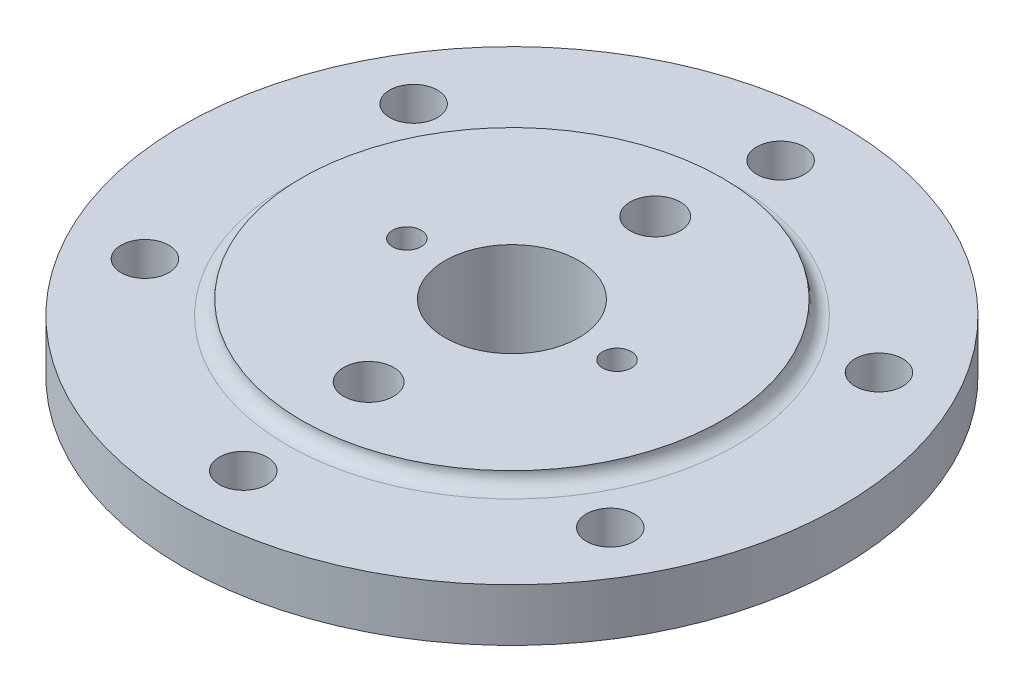
ISO-10303-21;
HEADER;
FILE_DESCRIPTION(('STEP AP214'),'2;1');
FILE_NAME('part.step','',(''),(''),'','','');
FILE_SCHEMA(('AUTOMOTIVE_DESIGN { 1 0 10303 214 1 1 1 1 }'));
ENDSEC;
DATA;
#1=APPLICATION_CONTEXT('core data for automotive mechanical design processes');
#2=APPLICATION_PROTOCOL_DEFINITION('international standard','automotive_design',2000,#1);
#3=PRODUCT_CONTEXT('',#1,'mechanical');
#4=PRODUCT('Part','Part','',(#3));
#5=PRODUCT_RELATED_PRODUCT_CATEGORY('part','',(#4));
#6=PRODUCT_DEFINITION_FORMATION('','',#4);
#7=PRODUCT_DEFINITION_CONTEXT('part definition',#1,'design');
#8=PRODUCT_DEFINITION('design','',#6,#7);
#9=PRODUCT_DEFINITION_SHAPE('','',#8);
#10=(LENGTH_UNIT() NAMED_UNIT(*) SI_UNIT(.MILLI.,.METRE.));
#11=(NAMED_UNIT(*) PLANE_ANGLE_UNIT() SI_UNIT($,.RADIAN.));
#12=(NAMED_UNIT(*) SI_UNIT($,.STERADIAN.) SOLID_ANGLE_UNIT());
#13=UNCERTAINTY_MEASURE_WITH_UNIT(LENGTH_MEASURE(1.E-05),#10,'distance_accuracy_value','');
#14=(GEOMETRIC_REPRESENTATION_CONTEXT(3) GLOBAL_UNCERTAINTY_ASSIGNED_CONTEXT((#13)) GLOBAL_UNIT_ASSIGNED_CONTEXT((#10,
#11,#12)) REPRESENTATION_CONTEXT('',''));
#15=CARTESIAN_POINT('',(0.,0.,0.));
#16=DIRECTION('',(0.,0.,1.));
#17=DIRECTION('',(1.,0.,0.));
#18=AXIS2_PLACEMENT_3D('',#15,#16,#17);
#19=CARTESIAN_POINT('',(0.,0.,0.));
#20=DIRECTION('',(0.,1.,0.));
#21=DIRECTION('',(0.,0.,1.));
#22=AXIS2_PLACEMENT_3D('',#19,#20,#21);
#23=TOROIDAL_SURFACE('',#22,94.,6.);
#24=CARTESIAN_POINT('',(0.,0.,0.));
#25=DIRECTION('',(0.,1.,0.));
#26=DIRECTION('',(0.,0.,1.));
#27=AXIS2_PLACEMENT_3D('',#24,#25,#26);
#28=CIRCLE('',#27,88.);
#29=CARTESIAN_POINT('',(0.,0.,88.));
#30=VERTEX_POINT('',#29);
#31=EDGE_CURVE('E11',#30,#30,#28,.T.);
#32=ORIENTED_EDGE('',*,*,#31,.F.);
#33=EDGE_LOOP('',(#32));
#34=FACE_BOUND('',#33,.T.);
#35=CARTESIAN_POINT('',(0.,-6.00000000000002,0.));
#36=DIRECTION('',(0.,1.,0.));
#37=DIRECTION('',(0.,0.,1.));
#38=AXIS2_PLACEMENT_3D('',#35,#36,#37);
#39=CIRCLE('',#38,94.);
#40=CARTESIAN_POINT('',(0.,-6.00000000000003,94.));
#41=VERTEX_POINT('',#40);
#42=EDGE_CURVE('E138',#41,#41,#39,.T.);
#43=ORIENTED_EDGE('',*,*,#42,.T.);
#44=EDGE_LOOP('',(#43));
#45=FACE_BOUND('',#44,.T.);
#46=ADVANCED_FACE('F49',(#34,#45),#23,.F.);
#47=CARTESIAN_POINT('',(0.,0.,-28.));
#48=DIRECTION('',(0.,-1.,0.));
#49=DIRECTION('',(0.,0.,-1.));
#50=AXIS2_PLACEMENT_3D('',#47,#48,#49);
#51=PLANE('',#50);
#52=CARTESIAN_POINT('',(-44.,0.,0.));
#53=DIRECTION('',(0.,1.,0.));
#54=DIRECTION('',(0.,0.,1.));
#55=AXIS2_PLACEMENT_3D('',#52,#53,#54);
#56=CIRCLE('',#55,6.);
#57=CARTESIAN_POINT('',(-44.,0.,6.));
#58=VERTEX_POINT('',#57);
#59=EDGE_CURVE('E80',#58,#58,#56,.T.);
#60=ORIENTED_EDGE('',*,*,#59,.F.);
#61=EDGE_LOOP('',(#60));
#62=FACE_BOUND('',#61,.T.);
#63=CARTESIAN_POINT('',(44.,0.,0.));
#64=DIRECTION('',(0.,1.,0.));
#65=DIRECTION('',(0.,0.,1.));
#66=AXIS2_PLACEMENT_3D('',#63,#64,#65);
#67=CIRCLE('',#66,6.);
#68=CARTESIAN_POINT('',(44.,0.,5.99999999999998));
#69=VERTEX_POINT('',#68);
#70=EDGE_CURVE('E79',#69,#69,#67,.T.);
#71=ORIENTED_EDGE('',*,*,#70,.F.);
#72=EDGE_LOOP('',(#71));
#73=FACE_BOUND('',#72,.T.);
#74=CARTESIAN_POINT('',(0.,0.,-60.));
#75=DIRECTION('',(0.,1.,0.));
#76=DIRECTION('',(0.,0.,1.));
#77=AXIS2_PLACEMENT_3D('',#74,#75,#76);
#78=CIRCLE('',#77,10.5);
#79=CARTESIAN_POINT('',(0.,0.,-49.5));
#80=VERTEX_POINT('',#79);
#81=EDGE_CURVE('E90',#80,#80,#78,.T.);
#82=ORIENTED_EDGE('',*,*,#81,.F.);
#83=EDGE_LOOP('',(#82));
#84=FACE_BOUND('',#83,.T.);
#85=CARTESIAN_POINT('',(0.,0.,60.));
#86=DIRECTION('',(0.,1.,0.));
#87=DIRECTION('',(0.,0.,1.));
#88=AXIS2_PLACEMENT_3D('',#85,#86,#87);
#89=CIRCLE('',#88,10.5);
#90=CARTESIAN_POINT('',(0.,0.,70.5));
#91=VERTEX_POINT('',#90);
#92=EDGE_CURVE('E96',#91,#91,#89,.T.);
#93=ORIENTED_EDGE('',*,*,#92,.F.);
#94=EDGE_LOOP('',(#93));
#95=FACE_BOUND('',#94,.T.);
#96=CARTESIAN_POINT('',(0.,0.,0.));
#97=DIRECTION('',(0.,1.,0.));
#98=DIRECTION('',(0.,0.,1.));
#99=AXIS2_PLACEMENT_3D('',#96,#97,#98);
#100=CIRCLE('',#99,28.);
#101=CARTESIAN_POINT('',(0.,0.,28.));
#102=VERTEX_POINT('',#101);
#103=EDGE_CURVE('E56',#102,#102,#100,.T.);
#104=ORIENTED_EDGE('',*,*,#103,.F.);
#105=EDGE_LOOP('',(#104));
#106=FACE_BOUND('',#105,.T.);
#107=ORIENTED_EDGE('',*,*,#31,.T.);
#108=EDGE_LOOP('',(#107));
#109=FACE_BOUND('',#108,.T.);
#110=ADVANCED_FACE('F169',(#62,#73,#84,#95,#106,#109),#51,.F.);
#111=CARTESIAN_POINT('',(0.,70.4543042547886,0.));
#112=DIRECTION('',(0.,1.,0.));
#113=DIRECTION('',(0.,0.,1.));
#114=AXIS2_PLACEMENT_3D('',#111,#112,#113);
#115=CYLINDRICAL_SURFACE('',#114,28.);
#116=CARTESIAN_POINT('',(0.,-41.9170962313453,0.));
#117=DIRECTION('',(0.,1.,0.));
#118=DIRECTION('',(0.,0.,1.));
#119=AXIS2_PLACEMENT_3D('',#116,#117,#118);
#120=CIRCLE('',#119,28.);
#121=CARTESIAN_POINT('',(0.,-41.9170962313453,28.));
#122=VERTEX_POINT('',#121);
#123=EDGE_CURVE('E162',#122,#122,#120,.T.);
#124=ORIENTED_EDGE('',*,*,#123,.F.);
#125=EDGE_LOOP('',(#124));
#126=FACE_BOUND('',#125,.T.);
#127=ORIENTED_EDGE('',*,*,#103,.T.);
#128=EDGE_LOOP('',(#127));
#129=FACE_BOUND('',#128,.T.);
#130=ADVANCED_FACE('F167',(#126,#129),#115,.F.);
#131=CARTESIAN_POINT('',(0.,-41.9170962313453,0.));
#132=DIRECTION('',(0.,1.,0.));
#133=DIRECTION('',(0.,0.,1.));
#134=AXIS2_PLACEMENT_3D('',#131,#132,#133);
#135=CONICAL_SURFACE('',#134,28.,1.0471975511966);
#136=CARTESIAN_POINT('',(0.,-50.,0.));
#137=DIRECTION('',(0.,1.,0.));
#138=DIRECTION('',(0.,0.,1.));
#139=AXIS2_PLACEMENT_3D('',#136,#137,#138);
#140=CIRCLE('',#139,14.);
#141=CARTESIAN_POINT('',(0.,-50.,14.));
#142=VERTEX_POINT('',#141);
#143=EDGE_CURVE('E159',#142,#142,#140,.T.);
#144=ORIENTED_EDGE('',*,*,#143,.F.);
#145=EDGE_LOOP('',(#144));
#146=FACE_BOUND('',#145,.T.);
#147=ORIENTED_EDGE('',*,*,#123,.T.);
#148=EDGE_LOOP('',(#147));
#149=FACE_BOUND('',#148,.T.);
#150=ADVANCED_FACE('F221',(#146,#149),#135,.F.);
#151=CARTESIAN_POINT('',(0.,70.4543042547886,0.));
#152=DIRECTION('',(0.,1.,0.));
#153=DIRECTION('',(0.,0.,1.));
#154=AXIS2_PLACEMENT_3D('',#151,#152,#153);
#155=CYLINDRICAL_SURFACE('',#154,14.);
#156=CARTESIAN_POINT('',(0.,-81.,0.));
#157=DIRECTION('',(0.,1.,0.));
#158=DIRECTION('',(0.,0.,1.));
#159=AXIS2_PLACEMENT_3D('',#156,#157,#158);
#160=CIRCLE('',#159,14.);
#161=CARTESIAN_POINT('',(0.,-81.,14.));
#162=VERTEX_POINT('',#161);
#163=EDGE_CURVE('E156',#162,#162,#160,.T.);
#164=ORIENTED_EDGE('',*,*,#163,.F.);
#165=EDGE_LOOP('',(#164));
#166=FACE_BOUND('',#165,.T.);
#167=ORIENTED_EDGE('',*,*,#143,.T.);
#168=EDGE_LOOP('',(#167));
#169=FACE_BOUND('',#168,.T.);
#170=ADVANCED_FACE('F215',(#166,#169),#155,.F.);
#171=CARTESIAN_POINT('',(0.,-81.,-35.));
#172=DIRECTION('',(0.,1.,0.));
#173=DIRECTION('',(0.,0.,1.));
#174=AXIS2_PLACEMENT_3D('',#171,#172,#173);
#175=PLANE('',#174);
#176=CARTESIAN_POINT('',(0.,-81.,0.));
#177=DIRECTION('',(0.,1.,0.));
#178=DIRECTION('',(0.,0.,1.));
#179=AXIS2_PLACEMENT_3D('',#176,#177,#178);
#180=CIRCLE('',#179,35.);
#181=CARTESIAN_POINT('',(0.,-81.,35.));
#182=VERTEX_POINT('',#181);
#183=EDGE_CURVE('E153',#182,#182,#180,.T.);
#184=ORIENTED_EDGE('',*,*,#183,.F.);
#185=EDGE_LOOP('',(#184));
#186=FACE_BOUND('',#185,.T.);
#187=ORIENTED_EDGE('',*,*,#163,.T.);
#188=EDGE_LOOP('',(#187));
#189=FACE_BOUND('',#188,.T.);
#190=ADVANCED_FACE('F209',(#186,#189),#175,.F.);
#191=CARTESIAN_POINT('',(0.,-81.,0.));
#192=DIRECTION('',(0.,1.,0.));
#193=DIRECTION('',(0.,0.,1.));
#194=AXIS2_PLACEMENT_3D('',#191,#192,#193);
#195=CONICAL_SURFACE('',#194,35.,0.774645889606347);
#196=CARTESIAN_POINT('',(0.,-34.,0.));
#197=DIRECTION('',(0.,1.,0.));
#198=DIRECTION('',(0.,0.,1.));
#199=AXIS2_PLACEMENT_3D('',#196,#197,#198);
#200=CIRCLE('',#199,81.);
#201=CARTESIAN_POINT('',(0.,-34.,81.));
#202=VERTEX_POINT('',#201);
#203=EDGE_CURVE('E150',#202,#202,#200,.T.);
#204=ORIENTED_EDGE('',*,*,#203,.F.);
#205=EDGE_LOOP('',(#204));
#206=FACE_BOUND('',#205,.T.);
#207=ORIENTED_EDGE('',*,*,#183,.T.);
#208=EDGE_LOOP('',(#207));
#209=FACE_BOUND('',#208,.T.);
#210=ADVANCED_FACE('F203',(#206,#209),#195,.T.);
#211=CARTESIAN_POINT('',(0.,70.4543042547886,0.));
#212=DIRECTION('',(0.,1.,0.));
#213=DIRECTION('',(0.,0.,1.));
#214=AXIS2_PLACEMENT_3D('',#211,#212,#213);
#215=CYLINDRICAL_SURFACE('',#214,81.);
#216=CARTESIAN_POINT('',(0.,-28.,0.));
#217=DIRECTION('',(0.,1.,0.));
#218=DIRECTION('',(0.,0.,1.));
#219=AXIS2_PLACEMENT_3D('',#216,#217,#218);
#220=CIRCLE('',#219,81.);
#221=CARTESIAN_POINT('',(0.,-28.,81.));
#222=VERTEX_POINT('',#221);
#223=EDGE_CURVE('E147',#222,#222,#220,.T.);
#224=ORIENTED_EDGE('',*,*,#223,.F.);
#225=EDGE_LOOP('',(#224));
#226=FACE_BOUND('',#225,.T.);
#227=ORIENTED_EDGE('',*,*,#203,.T.);
#228=EDGE_LOOP('',(#227));
#229=FACE_BOUND('',#228,.T.);
#230=ADVANCED_FACE('F196',(#226,#229),#215,.T.);
#231=CARTESIAN_POINT('',(0.,-28.,-138.));
#232=DIRECTION('',(0.,1.,0.));
#233=DIRECTION('',(0.,0.,1.));
#234=AXIS2_PLACEMENT_3D('',#231,#232,#233);
#235=PLANE('',#234);
#236=CARTESIAN_POINT('',(0.,-28.,-112.5));
#237=DIRECTION('',(0.,1.,0.));
#238=DIRECTION('',(0.,0.,1.));
#239=AXIS2_PLACEMENT_3D('',#236,#237,#238);
#240=CIRCLE('',#239,10.);
#241=CARTESIAN_POINT('',(0.,-28.,-102.5));
#242=VERTEX_POINT('',#241);
#243=EDGE_CURVE('E135',#242,#242,#240,.T.);
#244=ORIENTED_EDGE('',*,*,#243,.T.);
#245=EDGE_LOOP('',(#244));
#246=FACE_BOUND('',#245,.T.);
#247=CARTESIAN_POINT('',(-97.4278579257494,-28.,-56.2499999999999));
#248=DIRECTION('',(0.,1.,0.));
#249=DIRECTION('',(0.,0.,1.));
#250=AXIS2_PLACEMENT_3D('',#247,#248,#249);
#251=CIRCLE('',#250,10.0000000000013);
#252=CARTESIAN_POINT('',(-97.4278579257494,-28.,-46.2499999999986));
#253=VERTEX_POINT('',#252);
#254=EDGE_CURVE('E132',#253,#253,#251,.T.);
#255=ORIENTED_EDGE('',*,*,#254,.T.);
#256=EDGE_LOOP('',(#255));
#257=FACE_BOUND('',#256,.T.);
#258=CARTESIAN_POINT('',(-97.4278579257493,-28.,56.25));
#259=DIRECTION('',(0.,1.,0.));
#260=DIRECTION('',(0.,0.,1.));
#261=AXIS2_PLACEMENT_3D('',#258,#259,#260);
#262=CIRCLE('',#261,10.000000000001);
#263=CARTESIAN_POINT('',(-97.4278579257493,-28.,66.2500000000011));
#264=VERTEX_POINT('',#263);
#265=EDGE_CURVE('E129',#264,#264,#262,.T.);
#266=ORIENTED_EDGE('',*,*,#265,.T.);
#267=EDGE_LOOP('',(#266));
#268=FACE_BOUND('',#267,.T.);
#269=CARTESIAN_POINT('',(0.,-28.,112.5));
#270=DIRECTION('',(0.,1.,0.));
#271=DIRECTION('',(0.,0.,1.));
#272=AXIS2_PLACEMENT_3D('',#269,#270,#271);
#273=CIRCLE('',#272,10.0000000000008);
#274=CARTESIAN_POINT('',(0.,-28.,122.500000000001));
#275=VERTEX_POINT('',#274);
#276=EDGE_CURVE('E126',#275,#275,#273,.T.);
#277=ORIENTED_EDGE('',*,*,#276,.T.);
#278=EDGE_LOOP('',(#277));
#279=FACE_BOUND('',#278,.T.);
#280=CARTESIAN_POINT('',(97.4278579257494,-28.,56.25));
#281=DIRECTION('',(0.,1.,0.));
#282=DIRECTION('',(0.,0.,1.));
#283=AXIS2_PLACEMENT_3D('',#280,#281,#282);
#284=CIRCLE('',#283,10.0000000000005);
#285=CARTESIAN_POINT('',(97.4278579257494,-28.,66.2500000000005));
#286=VERTEX_POINT('',#285);
#287=EDGE_CURVE('E123',#286,#286,#284,.T.);
#288=ORIENTED_EDGE('',*,*,#287,.T.);
#289=EDGE_LOOP('',(#288));
#290=FACE_BOUND('',#289,.T.);
#291=CARTESIAN_POINT('',(97.4278579257493,-28.,-56.25));
#292=DIRECTION('',(0.,1.,0.));
#293=DIRECTION('',(0.,0.,1.));
#294=AXIS2_PLACEMENT_3D('',#291,#292,#293);
#295=CIRCLE('',#294,10.0000000000003);
#296=CARTESIAN_POINT('',(97.4278579257493,-28.,-46.2499999999998));
#297=VERTEX_POINT('',#296);
#298=EDGE_CURVE('E106',#297,#297,#295,.T.);
#299=ORIENTED_EDGE('',*,*,#298,.T.);
#300=EDGE_LOOP('',(#299));
#301=FACE_BOUND('',#300,.T.);
#302=CARTESIAN_POINT('',(0.,-28.,0.));
#303=DIRECTION('',(0.,1.,0.));
#304=DIRECTION('',(0.,0.,1.));
#305=AXIS2_PLACEMENT_3D('',#302,#303,#304);
#306=CIRCLE('',#305,138.);
#307=CARTESIAN_POINT('',(0.,-28.,138.));
#308=VERTEX_POINT('',#307);
#309=EDGE_CURVE('E144',#308,#308,#306,.T.);
#310=ORIENTED_EDGE('',*,*,#309,.F.);
#311=EDGE_LOOP('',(#310));
#312=FACE_BOUND('',#311,.T.);
#313=ORIENTED_EDGE('',*,*,#223,.T.);
#314=EDGE_LOOP('',(#313));
#315=FACE_BOUND('',#314,.T.);
#316=ADVANCED_FACE('F190',(#246,#257,#268,#279,#290,#301,#312,#315),#235,.F.);
#317=CARTESIAN_POINT('',(0.,70.4543042547886,0.));
#318=DIRECTION('',(0.,1.,0.));
#319=DIRECTION('',(0.,0.,1.));
#320=AXIS2_PLACEMENT_3D('',#317,#318,#319);
#321=CYLINDRICAL_SURFACE('',#320,138.);
#322=CARTESIAN_POINT('',(0.,-6.00000000000002,0.));
#323=DIRECTION('',(0.,1.,0.));
#324=DIRECTION('',(0.,0.,1.));
#325=AXIS2_PLACEMENT_3D('',#322,#323,#324);
#326=CIRCLE('',#325,138.);
#327=CARTESIAN_POINT('',(0.,-6.00000000000004,138.));
#328=VERTEX_POINT('',#327);
#329=EDGE_CURVE('E141',#328,#328,#326,.T.);
#330=ORIENTED_EDGE('',*,*,#329,.F.);
#331=EDGE_LOOP('',(#330));
#332=FACE_BOUND('',#331,.T.);
#333=ORIENTED_EDGE('',*,*,#309,.T.);
#334=EDGE_LOOP('',(#333));
#335=FACE_BOUND('',#334,.T.);
#336=ADVANCED_FACE('F183',(#332,#335),#321,.T.);
#337=CARTESIAN_POINT('',(0.,-6.,-94.));
#338=DIRECTION('',(0.,-1.,0.));
#339=DIRECTION('',(0.,0.,-1.));
#340=AXIS2_PLACEMENT_3D('',#337,#338,#339);
#341=PLANE('',#340);
#342=CARTESIAN_POINT('',(0.,-6.,-112.5));
#343=DIRECTION('',(0.,1.,0.));
#344=DIRECTION('',(0.,0.,1.));
#345=AXIS2_PLACEMENT_3D('',#342,#343,#344);
#346=CIRCLE('',#345,10.);
#347=CARTESIAN_POINT('',(0.,-6.,-102.5));
#348=VERTEX_POINT('',#347);
#349=EDGE_CURVE('E103',#348,#348,#346,.T.);
#350=ORIENTED_EDGE('',*,*,#349,.F.);
#351=EDGE_LOOP('',(#350));
#352=FACE_BOUND('',#351,.T.);
#353=CARTESIAN_POINT('',(-97.4278579257494,-6.00000000000001,-56.2499999999999));
#354=DIRECTION('',(0.,1.,0.));
#355=DIRECTION('',(0.,0.,1.));
#356=AXIS2_PLACEMENT_3D('',#353,#354,#355);
#357=CIRCLE('',#356,10.0000000000013);
#358=CARTESIAN_POINT('',(-97.4278579257494,-6.00000000000001,-46.2499999999986));
#359=VERTEX_POINT('',#358);
#360=EDGE_CURVE('E102',#359,#359,#357,.T.);
#361=ORIENTED_EDGE('',*,*,#360,.F.);
#362=EDGE_LOOP('',(#361));
#363=FACE_BOUND('',#362,.T.);
#364=CARTESIAN_POINT('',(-97.4278579257493,-6.00000000000002,56.25));
#365=DIRECTION('',(0.,1.,0.));
#366=DIRECTION('',(0.,0.,1.));
#367=AXIS2_PLACEMENT_3D('',#364,#365,#366);
#368=CIRCLE('',#367,10.000000000001);
#369=CARTESIAN_POINT('',(-97.4278579257493,-6.00000000000002,66.2500000000011));
#370=VERTEX_POINT('',#369);
#371=EDGE_CURVE('E110',#370,#370,#368,.T.);
#372=ORIENTED_EDGE('',*,*,#371,.F.);
#373=EDGE_LOOP('',(#372));
#374=FACE_BOUND('',#373,.T.);
#375=CARTESIAN_POINT('',(0.,-6.00000000000003,112.5));
#376=DIRECTION('',(0.,1.,0.));
#377=DIRECTION('',(0.,0.,1.));
#378=AXIS2_PLACEMENT_3D('',#375,#376,#377);
#379=CIRCLE('',#378,10.0000000000008);
#380=CARTESIAN_POINT('',(0.,-6.00000000000003,122.500000000001));
#381=VERTEX_POINT('',#380);
#382=EDGE_CURVE('E116',#381,#381,#379,.T.);
#383=ORIENTED_EDGE('',*,*,#382,.F.);
#384=EDGE_LOOP('',(#383));
#385=FACE_BOUND('',#384,.T.);
#386=CARTESIAN_POINT('',(97.4278579257494,-6.00000000000002,56.25));
#387=DIRECTION('',(0.,1.,0.));
#388=DIRECTION('',(0.,0.,1.));
#389=AXIS2_PLACEMENT_3D('',#386,#387,#388);
#390=CIRCLE('',#389,10.0000000000005);
#391=CARTESIAN_POINT('',(97.4278579257494,-6.00000000000002,66.2500000000005));
#392=VERTEX_POINT('',#391);
#393=EDGE_CURVE('E113',#392,#392,#390,.T.);
#394=ORIENTED_EDGE('',*,*,#393,.F.);
#395=EDGE_LOOP('',(#394));
#396=FACE_BOUND('',#395,.T.);
#397=CARTESIAN_POINT('',(97.4278579257493,-6.00000000000001,-56.25));
#398=DIRECTION('',(0.,1.,0.));
#399=DIRECTION('',(0.,0.,1.));
#400=AXIS2_PLACEMENT_3D('',#397,#398,#399);
#401=CIRCLE('',#400,10.0000000000003);
#402=CARTESIAN_POINT('',(97.4278579257493,-6.00000000000001,-46.2499999999998));
#403=VERTEX_POINT('',#402);
#404=EDGE_CURVE('E107',#403,#403,#401,.T.);
#405=ORIENTED_EDGE('',*,*,#404,.F.);
#406=EDGE_LOOP('',(#405));
#407=FACE_BOUND('',#406,.T.);
#408=ORIENTED_EDGE('',*,*,#42,.F.);
#409=EDGE_LOOP('',(#408));
#410=FACE_BOUND('',#409,.T.);
#411=ORIENTED_EDGE('',*,*,#329,.T.);
#412=EDGE_LOOP('',(#411));
#413=FACE_BOUND('',#412,.T.);
#414=ADVANCED_FACE('F179',(#352,#363,#374,#385,#396,#407,#410,#413),#341,.F.);
#415=CARTESIAN_POINT('',(97.4278579257493,-81.,-56.25));
#416=DIRECTION('',(0.,1.,0.));
#417=DIRECTION('',(0.,0.,1.));
#418=AXIS2_PLACEMENT_3D('',#415,#416,#417);
#419=CYLINDRICAL_SURFACE('',#418,10.0000000000003);
#420=ORIENTED_EDGE('',*,*,#404,.T.);
#421=EDGE_LOOP('',(#420));
#422=FACE_BOUND('',#421,.T.);
#423=ORIENTED_EDGE('',*,*,#298,.F.);
#424=EDGE_LOOP('',(#423));
#425=FACE_BOUND('',#424,.T.);
#426=ADVANCED_FACE('F182',(#422,#425),#419,.F.);
#427=CARTESIAN_POINT('',(97.4278579257494,-81.,56.25));
#428=DIRECTION('',(0.,1.,0.));
#429=DIRECTION('',(0.,0.,1.));
#430=AXIS2_PLACEMENT_3D('',#427,#428,#429);
#431=CYLINDRICAL_SURFACE('',#430,10.0000000000005);
#432=ORIENTED_EDGE('',*,*,#393,.T.);
#433=EDGE_LOOP('',(#432));
#434=FACE_BOUND('',#433,.T.);
#435=ORIENTED_EDGE('',*,*,#287,.F.);
#436=EDGE_LOOP('',(#435));
#437=FACE_BOUND('',#436,.T.);
#438=ADVANCED_FACE('F243',(#434,#437),#431,.F.);
#439=CARTESIAN_POINT('',(0.,-81.0000000000001,112.5));
#440=DIRECTION('',(0.,1.,0.));
#441=DIRECTION('',(0.,0.,1.));
#442=AXIS2_PLACEMENT_3D('',#439,#440,#441);
#443=CYLINDRICAL_SURFACE('',#442,10.0000000000008);
#444=ORIENTED_EDGE('',*,*,#382,.T.);
#445=EDGE_LOOP('',(#444));
#446=FACE_BOUND('',#445,.T.);
#447=ORIENTED_EDGE('',*,*,#276,.F.);
#448=EDGE_LOOP('',(#447));
#449=FACE_BOUND('',#448,.T.);
#450=ADVANCED_FACE('F239',(#446,#449),#443,.F.);
#451=CARTESIAN_POINT('',(-97.4278579257493,-81.,56.25));
#452=DIRECTION('',(0.,1.,0.));
#453=DIRECTION('',(0.,0.,1.));
#454=AXIS2_PLACEMENT_3D('',#451,#452,#453);
#455=CYLINDRICAL_SURFACE('',#454,10.000000000001);
#456=ORIENTED_EDGE('',*,*,#371,.T.);
#457=EDGE_LOOP('',(#456));
#458=FACE_BOUND('',#457,.T.);
#459=ORIENTED_EDGE('',*,*,#265,.F.);
#460=EDGE_LOOP('',(#459));
#461=FACE_BOUND('',#460,.T.);
#462=ADVANCED_FACE('F235',(#458,#461),#455,.F.);
#463=CARTESIAN_POINT('',(-97.4278579257494,-81.,-56.2499999999999));
#464=DIRECTION('',(0.,1.,0.));
#465=DIRECTION('',(0.,0.,1.));
#466=AXIS2_PLACEMENT_3D('',#463,#464,#465);
#467=CYLINDRICAL_SURFACE('',#466,10.0000000000013);
#468=ORIENTED_EDGE('',*,*,#360,.T.);
#469=EDGE_LOOP('',(#468));
#470=FACE_BOUND('',#469,.T.);
#471=ORIENTED_EDGE('',*,*,#254,.F.);
#472=EDGE_LOOP('',(#471));
#473=FACE_BOUND('',#472,.T.);
#474=ADVANCED_FACE('F238',(#470,#473),#467,.F.);
#475=CARTESIAN_POINT('',(0.,-81.,-112.5));
#476=DIRECTION('',(0.,1.,0.));
#477=DIRECTION('',(0.,0.,1.));
#478=AXIS2_PLACEMENT_3D('',#475,#476,#477);
#479=CYLINDRICAL_SURFACE('',#478,10.);
#480=ORIENTED_EDGE('',*,*,#349,.T.);
#481=EDGE_LOOP('',(#480));
#482=FACE_BOUND('',#481,.T.);
#483=ORIENTED_EDGE('',*,*,#243,.F.);
#484=EDGE_LOOP('',(#483));
#485=FACE_BOUND('',#484,.T.);
#486=ADVANCED_FACE('F253',(#482,#485),#479,.F.);
#487=CARTESIAN_POINT('',(0.,-27.,60.));
#488=DIRECTION('',(0.,1.,0.));
#489=DIRECTION('',(0.,0.,1.));
#490=AXIS2_PLACEMENT_3D('',#487,#488,#489);
#491=CONICAL_SURFACE('',#490,10.5,1.0471975511966);
#492=CARTESIAN_POINT('',(0.,-33.0621778264911,60.));
#493=VERTEX_POINT('',#492);
#494=VERTEX_LOOP('',#493);
#495=FACE_BOUND('',#494,.T.);
#496=CARTESIAN_POINT('',(0.,-27.,60.));
#497=DIRECTION('',(0.,1.,0.));
#498=DIRECTION('',(0.,0.,1.));
#499=AXIS2_PLACEMENT_3D('',#496,#497,#498);
#500=CIRCLE('',#499,10.5);
#501=CARTESIAN_POINT('',(0.,-27.,70.5));
#502=VERTEX_POINT('',#501);
#503=EDGE_CURVE('E99',#502,#502,#500,.T.);
#504=ORIENTED_EDGE('',*,*,#503,.T.);
#505=EDGE_LOOP('',(#504));
#506=FACE_BOUND('',#505,.T.);
#507=ADVANCED_FACE('F257',(#495,#506),#491,.F.);
#508=CARTESIAN_POINT('',(0.,0.,60.));
#509=DIRECTION('',(0.,1.,0.));
#510=DIRECTION('',(0.,0.,1.));
#511=AXIS2_PLACEMENT_3D('',#508,#509,#510);
#512=CYLINDRICAL_SURFACE('',#511,10.5);
#513=ORIENTED_EDGE('',*,*,#503,.F.);
#514=EDGE_LOOP('',(#513));
#515=FACE_BOUND('',#514,.T.);
#516=ORIENTED_EDGE('',*,*,#92,.T.);
#517=EDGE_LOOP('',(#516));
#518=FACE_BOUND('',#517,.T.);
#519=ADVANCED_FACE('F261',(#515,#518),#512,.F.);
#520=CARTESIAN_POINT('',(0.,-27.,-60.));
#521=DIRECTION('',(0.,1.,0.));
#522=DIRECTION('',(0.,0.,1.));
#523=AXIS2_PLACEMENT_3D('',#520,#521,#522);
#524=CONICAL_SURFACE('',#523,10.5,1.0471975511966);
#525=CARTESIAN_POINT('',(0.,-33.0621778264911,-60.));
#526=VERTEX_POINT('',#525);
#527=VERTEX_LOOP('',#526);
#528=FACE_BOUND('',#527,.T.);
#529=CARTESIAN_POINT('',(0.,-27.,-60.));
#530=DIRECTION('',(0.,1.,0.));
#531=DIRECTION('',(0.,0.,1.));
#532=AXIS2_PLACEMENT_3D('',#529,#530,#531);
#533=CIRCLE('',#532,10.5);
#534=CARTESIAN_POINT('',(0.,-27.,-49.5));
#535=VERTEX_POINT('',#534);
#536=EDGE_CURVE('E93',#535,#535,#533,.T.);
#537=ORIENTED_EDGE('',*,*,#536,.T.);
#538=EDGE_LOOP('',(#537));
#539=FACE_BOUND('',#538,.T.);
#540=ADVANCED_FACE('F264',(#528,#539),#524,.F.);
#541=CARTESIAN_POINT('',(0.,0.,-60.));
#542=DIRECTION('',(0.,1.,0.));
#543=DIRECTION('',(0.,0.,1.));
#544=AXIS2_PLACEMENT_3D('',#541,#542,#543);
#545=CYLINDRICAL_SURFACE('',#544,10.5);
#546=ORIENTED_EDGE('',*,*,#536,.F.);
#547=EDGE_LOOP('',(#546));
#548=FACE_BOUND('',#547,.T.);
#549=ORIENTED_EDGE('',*,*,#81,.T.);
#550=EDGE_LOOP('',(#549));
#551=FACE_BOUND('',#550,.T.);
#552=ADVANCED_FACE('F268',(#548,#551),#545,.F.);
#553=CARTESIAN_POINT('',(44.,-15.,0.));
#554=DIRECTION('',(0.,1.,0.));
#555=DIRECTION('',(0.,0.,1.));
#556=AXIS2_PLACEMENT_3D('',#553,#554,#555);
#557=CONICAL_SURFACE('',#556,6.,1.0471975511966);
#558=CARTESIAN_POINT('',(44.,-18.4641016151378,0.));
#559=VERTEX_POINT('',#558);
#560=VERTEX_LOOP('',#559);
#561=FACE_BOUND('',#560,.T.);
#562=CARTESIAN_POINT('',(44.,-15.,0.));
#563=DIRECTION('',(0.,1.,0.));
#564=DIRECTION('',(0.,0.,1.));
#565=AXIS2_PLACEMENT_3D('',#562,#563,#564);
#566=CIRCLE('',#565,6.);
#567=CARTESIAN_POINT('',(44.,-15.,5.99999999999998));
#568=VERTEX_POINT('',#567);
#569=EDGE_CURVE('E83',#568,#568,#566,.T.);
#570=ORIENTED_EDGE('',*,*,#569,.T.);
#571=EDGE_LOOP('',(#570));
#572=FACE_BOUND('',#571,.T.);
#573=ADVANCED_FACE('F271',(#561,#572),#557,.F.);
#574=CARTESIAN_POINT('',(44.,0.,0.));
#575=DIRECTION('',(0.,1.,0.));
#576=DIRECTION('',(0.,0.,1.));
#577=AXIS2_PLACEMENT_3D('',#574,#575,#576);
#578=CYLINDRICAL_SURFACE('',#577,6.);
#579=ORIENTED_EDGE('',*,*,#569,.F.);
#580=EDGE_LOOP('',(#579));
#581=FACE_BOUND('',#580,.T.);
#582=ORIENTED_EDGE('',*,*,#70,.T.);
#583=EDGE_LOOP('',(#582));
#584=FACE_BOUND('',#583,.T.);
#585=ADVANCED_FACE('F73',(#581,#584),#578,.F.);
#586=CARTESIAN_POINT('',(-44.,-15.,0.));
#587=DIRECTION('',(0.,1.,0.));
#588=DIRECTION('',(0.,0.,1.));
#589=AXIS2_PLACEMENT_3D('',#586,#587,#588);
#590=CONICAL_SURFACE('',#589,6.,1.0471975511966);
#591=CARTESIAN_POINT('',(-44.,-18.4641016151378,0.));
#592=VERTEX_POINT('',#591);
#593=VERTEX_LOOP('',#592);
#594=FACE_BOUND('',#593,.T.);
#595=CARTESIAN_POINT('',(-44.,-15.,0.));
#596=DIRECTION('',(0.,1.,0.));
#597=DIRECTION('',(0.,0.,1.));
#598=AXIS2_PLACEMENT_3D('',#595,#596,#597);
#599=CIRCLE('',#598,6.);
#600=CARTESIAN_POINT('',(-44.,-15.,6.));
#601=VERTEX_POINT('',#600);
#602=EDGE_CURVE('E77',#601,#601,#599,.T.);
#603=ORIENTED_EDGE('',*,*,#602,.T.);
#604=EDGE_LOOP('',(#603));
#605=FACE_BOUND('',#604,.T.);
#606=ADVANCED_FACE('F69',(#594,#605),#590,.F.);
#607=CARTESIAN_POINT('',(-44.,0.,0.));
#608=DIRECTION('',(0.,1.,0.));
#609=DIRECTION('',(0.,0.,1.));
#610=AXIS2_PLACEMENT_3D('',#607,#608,#609);
#611=CYLINDRICAL_SURFACE('',#610,6.);
#612=ORIENTED_EDGE('',*,*,#602,.F.);
#613=EDGE_LOOP('',(#612));
#614=FACE_BOUND('',#613,.T.);
#615=ORIENTED_EDGE('',*,*,#59,.T.);
#616=EDGE_LOOP('',(#615));
#617=FACE_BOUND('',#616,.T.);
#618=ADVANCED_FACE('F72',(#614,#617),#611,.F.);
#619=CLOSED_SHELL('',(#46,#110,#130,#150,#170,#190,#210,#230,#316,#336,#414,#426,#438,#450,#462,
#474,#486,#507,#519,#540,#552,#573,#585,#606,#618));
#620=MANIFOLD_SOLID_BREP('B2',#619);
#621=ADVANCED_BREP_SHAPE_REPRESENTATION('',(#18,#620),#14);
#622=SHAPE_DEFINITION_REPRESENTATION(#9,#621);
ENDSEC;
END-ISO-10303-21;
